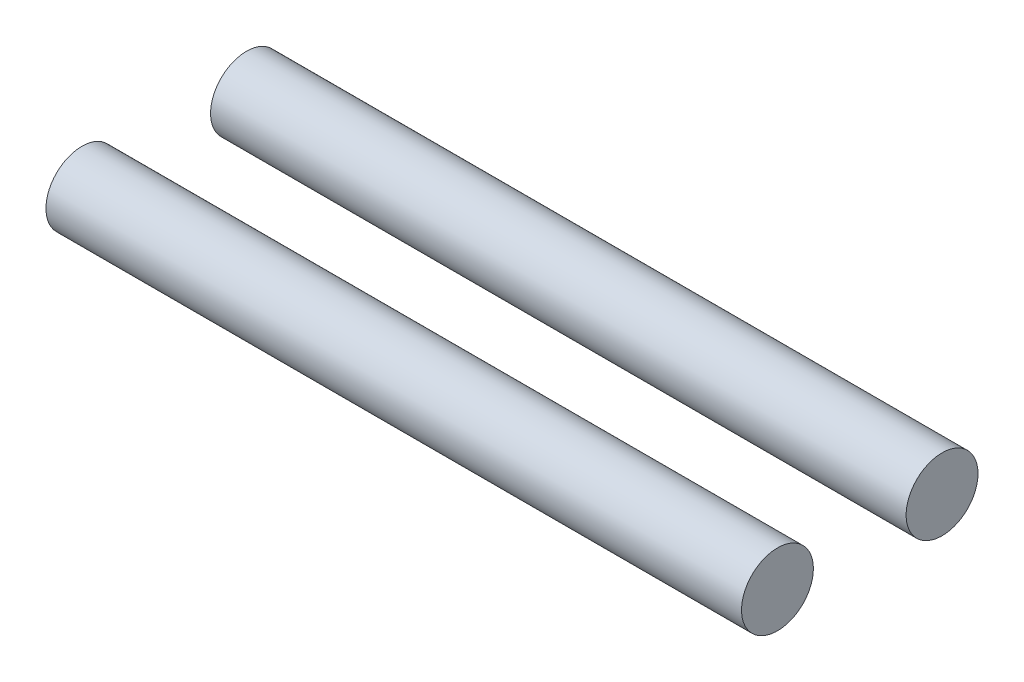
ISO-10303-21;
HEADER;
FILE_DESCRIPTION(('STEP AP214'),'2;1');
FILE_NAME('part.step','',(''),(''),'','','');
FILE_SCHEMA(('AUTOMOTIVE_DESIGN { 1 0 10303 214 1 1 1 1 }'));
ENDSEC;
DATA;
#1=APPLICATION_CONTEXT('core data for automotive mechanical design processes');
#2=APPLICATION_PROTOCOL_DEFINITION('international standard','automotive_design',2000,#1);
#3=PRODUCT_CONTEXT('',#1,'mechanical');
#4=PRODUCT('Part','Part','',(#3));
#5=PRODUCT_RELATED_PRODUCT_CATEGORY('part','',(#4));
#6=PRODUCT_DEFINITION_FORMATION('','',#4);
#7=PRODUCT_DEFINITION_CONTEXT('part definition',#1,'design');
#8=PRODUCT_DEFINITION('design','',#6,#7);
#9=PRODUCT_DEFINITION_SHAPE('','',#8);
#10=(LENGTH_UNIT() NAMED_UNIT(*) SI_UNIT(.MILLI.,.METRE.));
#11=(NAMED_UNIT(*) PLANE_ANGLE_UNIT() SI_UNIT($,.RADIAN.));
#12=(NAMED_UNIT(*) SI_UNIT($,.STERADIAN.) SOLID_ANGLE_UNIT());
#13=UNCERTAINTY_MEASURE_WITH_UNIT(LENGTH_MEASURE(1.E-05),#10,'distance_accuracy_value','');
#14=(GEOMETRIC_REPRESENTATION_CONTEXT(3) GLOBAL_UNCERTAINTY_ASSIGNED_CONTEXT((#13)) GLOBAL_UNIT_ASSIGNED_CONTEXT((#10,
#11,#12)) REPRESENTATION_CONTEXT('',''));
#15=CARTESIAN_POINT('',(0.,0.,0.));
#16=DIRECTION('',(0.,0.,1.));
#17=DIRECTION('',(1.,0.,0.));
#18=AXIS2_PLACEMENT_3D('',#15,#16,#17);
#19=CARTESIAN_POINT('',(0.,0.,-7.1));
#20=DIRECTION('',(1.,0.,0.));
#21=DIRECTION('',(0.,0.,-1.));
#22=AXIS2_PLACEMENT_3D('',#19,#20,#21);
#23=PLANE('',#22);
#24=CARTESIAN_POINT('',(0.,0.,-7.1));
#25=DIRECTION('',(1.,0.,0.));
#26=DIRECTION('',(0.,0.,-1.));
#27=AXIS2_PLACEMENT_3D('',#24,#25,#26);
#28=CIRCLE('',#27,1.55);
#29=CARTESIAN_POINT('',(0.,0.,-8.65));
#30=VERTEX_POINT('',#29);
#31=EDGE_CURVE('E51',#30,#30,#28,.T.);
#32=ORIENTED_EDGE('',*,*,#31,.T.);
#33=EDGE_LOOP('',(#32));
#34=FACE_BOUND('',#33,.T.);
#35=ADVANCED_FACE('F44',(#34),#23,.T.);
#36=CARTESIAN_POINT('',(-30.,0.,-7.1));
#37=DIRECTION('',(1.,0.,0.));
#38=DIRECTION('',(0.,0.,-1.));
#39=AXIS2_PLACEMENT_3D('',#36,#37,#38);
#40=PLANE('',#39);
#41=CARTESIAN_POINT('',(-30.,0.,-7.1));
#42=DIRECTION('',(1.,0.,0.));
#43=DIRECTION('',(0.,0.,-1.));
#44=AXIS2_PLACEMENT_3D('',#41,#42,#43);
#45=CIRCLE('',#44,1.55);
#46=CARTESIAN_POINT('',(-30.,0.,-8.65));
#47=VERTEX_POINT('',#46);
#48=EDGE_CURVE('E12',#47,#47,#45,.T.);
#49=ORIENTED_EDGE('',*,*,#48,.F.);
#50=EDGE_LOOP('',(#49));
#51=FACE_BOUND('',#50,.T.);
#52=ADVANCED_FACE('F60',(#51),#40,.F.);
#53=CARTESIAN_POINT('',(0.,0.,-7.1));
#54=DIRECTION('',(-1.,0.,0.));
#55=DIRECTION('',(0.,-1.,0.));
#56=AXIS2_PLACEMENT_3D('',#53,#54,#55);
#57=CYLINDRICAL_SURFACE('',#56,1.55);
#58=ORIENTED_EDGE('',*,*,#48,.T.);
#59=EDGE_LOOP('',(#58));
#60=FACE_BOUND('',#59,.T.);
#61=ORIENTED_EDGE('',*,*,#31,.F.);
#62=EDGE_LOOP('',(#61));
#63=FACE_BOUND('',#62,.T.);
#64=ADVANCED_FACE('F58',(#60,#63),#57,.T.);
#65=CLOSED_SHELL('',(#35,#52,#64));
#66=MANIFOLD_SOLID_BREP('B2',#65);
#67=CARTESIAN_POINT('',(0.,0.,0.));
#68=DIRECTION('',(1.,0.,0.));
#69=DIRECTION('',(0.,0.,-1.));
#70=AXIS2_PLACEMENT_3D('',#67,#68,#69);
#71=PLANE('',#70);
#72=CARTESIAN_POINT('',(0.,0.,0.));
#73=DIRECTION('',(1.,0.,0.));
#74=DIRECTION('',(0.,0.,-1.));
#75=AXIS2_PLACEMENT_3D('',#72,#73,#74);
#76=CIRCLE('',#75,1.55);
#77=CARTESIAN_POINT('',(0.,0.,-1.55));
#78=VERTEX_POINT('',#77);
#79=EDGE_CURVE('E93',#78,#78,#76,.T.);
#80=ORIENTED_EDGE('',*,*,#79,.T.);
#81=EDGE_LOOP('',(#80));
#82=FACE_BOUND('',#81,.T.);
#83=ADVANCED_FACE('F86',(#82),#71,.T.);
#84=CARTESIAN_POINT('',(-30.,0.,0.));
#85=DIRECTION('',(1.,0.,0.));
#86=DIRECTION('',(0.,0.,-1.));
#87=AXIS2_PLACEMENT_3D('',#84,#85,#86);
#88=PLANE('',#87);
#89=CARTESIAN_POINT('',(-30.,0.,0.));
#90=DIRECTION('',(1.,0.,0.));
#91=DIRECTION('',(0.,0.,-1.));
#92=AXIS2_PLACEMENT_3D('',#89,#90,#91);
#93=CIRCLE('',#92,1.55);
#94=CARTESIAN_POINT('',(-30.,0.,-1.55));
#95=VERTEX_POINT('',#94);
#96=EDGE_CURVE('E42',#95,#95,#93,.T.);
#97=ORIENTED_EDGE('',*,*,#96,.F.);
#98=EDGE_LOOP('',(#97));
#99=FACE_BOUND('',#98,.T.);
#100=ADVANCED_FACE('F102',(#99),#88,.F.);
#101=CARTESIAN_POINT('',(0.,0.,0.));
#102=DIRECTION('',(-1.,0.,0.));
#103=DIRECTION('',(0.,-1.,0.));
#104=AXIS2_PLACEMENT_3D('',#101,#102,#103);
#105=CYLINDRICAL_SURFACE('',#104,1.55);
#106=ORIENTED_EDGE('',*,*,#96,.T.);
#107=EDGE_LOOP('',(#106));
#108=FACE_BOUND('',#107,.T.);
#109=ORIENTED_EDGE('',*,*,#79,.F.);
#110=EDGE_LOOP('',(#109));
#111=FACE_BOUND('',#110,.T.);
#112=ADVANCED_FACE('F100',(#108,#111),#105,.T.);
#113=CLOSED_SHELL('',(#83,#100,#112));
#114=MANIFOLD_SOLID_BREP('B6',#113);
#115=ADVANCED_BREP_SHAPE_REPRESENTATION('',(#18,#66,#114),#14);
#116=SHAPE_DEFINITION_REPRESENTATION(#9,#115);
ENDSEC;
END-ISO-10303-21;
